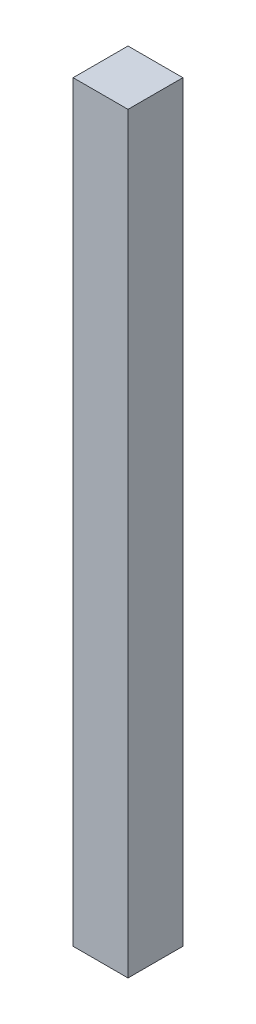
ISO-10303-21;
HEADER;
FILE_DESCRIPTION(('STEP AP214'),'2;1');
FILE_NAME('part.step','',(''),(''),'','','');
FILE_SCHEMA(('AUTOMOTIVE_DESIGN { 1 0 10303 214 1 1 1 1 }'));
ENDSEC;
DATA;
#1=APPLICATION_CONTEXT('core data for automotive mechanical design processes');
#2=APPLICATION_PROTOCOL_DEFINITION('international standard','automotive_design',2000,#1);
#3=PRODUCT_CONTEXT('',#1,'mechanical');
#4=PRODUCT('Part','Part','',(#3));
#5=PRODUCT_RELATED_PRODUCT_CATEGORY('part','',(#4));
#6=PRODUCT_DEFINITION_FORMATION('','',#4);
#7=PRODUCT_DEFINITION_CONTEXT('part definition',#1,'design');
#8=PRODUCT_DEFINITION('design','',#6,#7);
#9=PRODUCT_DEFINITION_SHAPE('','',#8);
#10=(LENGTH_UNIT() NAMED_UNIT(*) SI_UNIT(.MILLI.,.METRE.));
#11=(NAMED_UNIT(*) PLANE_ANGLE_UNIT() SI_UNIT($,.RADIAN.));
#12=(NAMED_UNIT(*) SI_UNIT($,.STERADIAN.) SOLID_ANGLE_UNIT());
#13=UNCERTAINTY_MEASURE_WITH_UNIT(LENGTH_MEASURE(1.E-05),#10,'distance_accuracy_value','');
#14=(GEOMETRIC_REPRESENTATION_CONTEXT(3) GLOBAL_UNCERTAINTY_ASSIGNED_CONTEXT((#13)) GLOBAL_UNIT_ASSIGNED_CONTEXT((#10,
#11,#12)) REPRESENTATION_CONTEXT('',''));
#15=CARTESIAN_POINT('',(0.,0.,0.));
#16=DIRECTION('',(0.,0.,1.));
#17=DIRECTION('',(1.,0.,0.));
#18=AXIS2_PLACEMENT_3D('',#15,#16,#17);
#19=CARTESIAN_POINT('',(0.,1219.2,0.));
#20=DIRECTION('',(-1.,0.,0.));
#21=DIRECTION('',(0.,0.,1.));
#22=AXIS2_PLACEMENT_3D('',#19,#20,#21);
#23=PLANE('',#22);
#24=DIRECTION('',(0.,0.,-1.));
#25=VECTOR('',#24,1.);
#26=CARTESIAN_POINT('',(0.,0.,0.));
#27=LINE('',#26,#25);
#28=CARTESIAN_POINT('',(0.,0.,0.));
#29=VERTEX_POINT('',#28);
#30=CARTESIAN_POINT('',(0.,0.,-88.9));
#31=VERTEX_POINT('',#30);
#32=EDGE_CURVE('E109',#29,#31,#27,.T.);
#33=ORIENTED_EDGE('',*,*,#32,.T.);
#34=DIRECTION('',(0.,-1.,0.));
#35=VECTOR('',#34,1.);
#36=CARTESIAN_POINT('',(0.,1219.2,-88.9));
#37=LINE('',#36,#35);
#38=CARTESIAN_POINT('',(0.,1219.2,-88.9));
#39=VERTEX_POINT('',#38);
#40=EDGE_CURVE('E11',#39,#31,#37,.T.);
#41=ORIENTED_EDGE('',*,*,#40,.F.);
#42=DIRECTION('',(0.,0.,-1.));
#43=VECTOR('',#42,1.);
#44=CARTESIAN_POINT('',(0.,1219.2,0.));
#45=LINE('',#44,#43);
#46=CARTESIAN_POINT('',(0.,1219.2,0.));
#47=VERTEX_POINT('',#46);
#48=EDGE_CURVE('E93',#47,#39,#45,.T.);
#49=ORIENTED_EDGE('',*,*,#48,.F.);
#50=DIRECTION('',(0.,-1.,0.));
#51=VECTOR('',#50,1.);
#52=CARTESIAN_POINT('',(0.,1219.2,0.));
#53=LINE('',#52,#51);
#54=EDGE_CURVE('E105',#47,#29,#53,.T.);
#55=ORIENTED_EDGE('',*,*,#54,.T.);
#56=EDGE_LOOP('',(#33,#41,#49,#55));
#57=FACE_BOUND('',#56,.T.);
#58=ADVANCED_FACE('F41',(#57),#23,.F.);
#59=CARTESIAN_POINT('',(0.,1219.2,-88.9));
#60=DIRECTION('',(0.,0.,1.));
#61=DIRECTION('',(1.,0.,0.));
#62=AXIS2_PLACEMENT_3D('',#59,#60,#61);
#63=PLANE('',#62);
#64=DIRECTION('',(-1.,0.,0.));
#65=VECTOR('',#64,1.);
#66=CARTESIAN_POINT('',(0.,0.,-88.9));
#67=LINE('',#66,#65);
#68=CARTESIAN_POINT('',(-88.9,0.,-88.9));
#69=VERTEX_POINT('',#68);
#70=EDGE_CURVE('E98',#31,#69,#67,.T.);
#71=ORIENTED_EDGE('',*,*,#70,.T.);
#72=DIRECTION('',(0.,-1.,0.));
#73=VECTOR('',#72,1.);
#74=CARTESIAN_POINT('',(-88.9,1219.2,-88.9));
#75=LINE('',#74,#73);
#76=CARTESIAN_POINT('',(-88.9,1219.2,-88.9));
#77=VERTEX_POINT('',#76);
#78=EDGE_CURVE('E50',#77,#69,#75,.T.);
#79=ORIENTED_EDGE('',*,*,#78,.F.);
#80=DIRECTION('',(-1.,0.,0.));
#81=VECTOR('',#80,1.);
#82=CARTESIAN_POINT('',(0.,1219.2,-88.9));
#83=LINE('',#82,#81);
#84=EDGE_CURVE('E88',#39,#77,#83,.T.);
#85=ORIENTED_EDGE('',*,*,#84,.F.);
#86=ORIENTED_EDGE('',*,*,#40,.T.);
#87=EDGE_LOOP('',(#71,#79,#85,#86));
#88=FACE_BOUND('',#87,.T.);
#89=ADVANCED_FACE('F97',(#88),#63,.F.);
#90=CARTESIAN_POINT('',(-88.9,1219.2,-88.9));
#91=DIRECTION('',(1.,0.,0.));
#92=DIRECTION('',(0.,0.,-1.));
#93=AXIS2_PLACEMENT_3D('',#90,#91,#92);
#94=PLANE('',#93);
#95=DIRECTION('',(0.,0.,1.));
#96=VECTOR('',#95,1.);
#97=CARTESIAN_POINT('',(-88.9,0.,-88.9));
#98=LINE('',#97,#96);
#99=CARTESIAN_POINT('',(-88.9,0.,0.));
#100=VERTEX_POINT('',#99);
#101=EDGE_CURVE('E75',#69,#100,#98,.T.);
#102=ORIENTED_EDGE('',*,*,#101,.T.);
#103=DIRECTION('',(0.,-1.,0.));
#104=VECTOR('',#103,1.);
#105=CARTESIAN_POINT('',(-88.9,1219.2,0.));
#106=LINE('',#105,#104);
#107=CARTESIAN_POINT('',(-88.9,1219.2,0.));
#108=VERTEX_POINT('',#107);
#109=EDGE_CURVE('E100',#108,#100,#106,.T.);
#110=ORIENTED_EDGE('',*,*,#109,.F.);
#111=DIRECTION('',(0.,0.,1.));
#112=VECTOR('',#111,1.);
#113=CARTESIAN_POINT('',(-88.9,1219.2,-88.9));
#114=LINE('',#113,#112);
#115=EDGE_CURVE('E91',#77,#108,#114,.T.);
#116=ORIENTED_EDGE('',*,*,#115,.F.);
#117=ORIENTED_EDGE('',*,*,#78,.T.);
#118=EDGE_LOOP('',(#102,#110,#116,#117));
#119=FACE_BOUND('',#118,.T.);
#120=ADVANCED_FACE('F101',(#119),#94,.F.);
#121=CARTESIAN_POINT('',(-88.9,1219.2,0.));
#122=DIRECTION('',(0.,0.,-1.));
#123=DIRECTION('',(-1.,0.,0.));
#124=AXIS2_PLACEMENT_3D('',#121,#122,#123);
#125=PLANE('',#124);
#126=DIRECTION('',(1.,0.,0.));
#127=VECTOR('',#126,1.);
#128=CARTESIAN_POINT('',(-88.9,0.,0.));
#129=LINE('',#128,#127);
#130=EDGE_CURVE('E81',#100,#29,#129,.T.);
#131=ORIENTED_EDGE('',*,*,#130,.T.);
#132=ORIENTED_EDGE('',*,*,#54,.F.);
#133=DIRECTION('',(1.,0.,0.));
#134=VECTOR('',#133,1.);
#135=CARTESIAN_POINT('',(-88.9,1219.2,0.));
#136=LINE('',#135,#134);
#137=EDGE_CURVE('E58',#108,#47,#136,.T.);
#138=ORIENTED_EDGE('',*,*,#137,.F.);
#139=ORIENTED_EDGE('',*,*,#109,.T.);
#140=EDGE_LOOP('',(#131,#132,#138,#139));
#141=FACE_BOUND('',#140,.T.);
#142=ADVANCED_FACE('F122',(#141),#125,.F.);
#143=CARTESIAN_POINT('',(0.,1219.2,0.));
#144=DIRECTION('',(0.,1.,0.));
#145=DIRECTION('',(0.,0.,1.));
#146=AXIS2_PLACEMENT_3D('',#143,#144,#145);
#147=PLANE('',#146);
#148=ORIENTED_EDGE('',*,*,#48,.T.);
#149=ORIENTED_EDGE('',*,*,#84,.T.);
#150=ORIENTED_EDGE('',*,*,#115,.T.);
#151=ORIENTED_EDGE('',*,*,#137,.T.);
#152=EDGE_LOOP('',(#148,#149,#150,#151));
#153=FACE_BOUND('',#152,.T.);
#154=ADVANCED_FACE('F89',(#153),#147,.T.);
#155=CARTESIAN_POINT('',(0.,0.,0.));
#156=DIRECTION('',(0.,1.,0.));
#157=DIRECTION('',(0.,0.,1.));
#158=AXIS2_PLACEMENT_3D('',#155,#156,#157);
#159=PLANE('',#158);
#160=ORIENTED_EDGE('',*,*,#32,.F.);
#161=ORIENTED_EDGE('',*,*,#130,.F.);
#162=ORIENTED_EDGE('',*,*,#101,.F.);
#163=ORIENTED_EDGE('',*,*,#70,.F.);
#164=EDGE_LOOP('',(#160,#161,#162,#163));
#165=FACE_BOUND('',#164,.T.);
#166=ADVANCED_FACE('F125',(#165),#159,.F.);
#167=CLOSED_SHELL('',(#58,#89,#120,#142,#154,#166));
#168=MANIFOLD_SOLID_BREP('B2',#167);
#169=ADVANCED_BREP_SHAPE_REPRESENTATION('',(#18,#168),#14);
#170=SHAPE_DEFINITION_REPRESENTATION(#9,#169);
ENDSEC;
END-ISO-10303-21;
